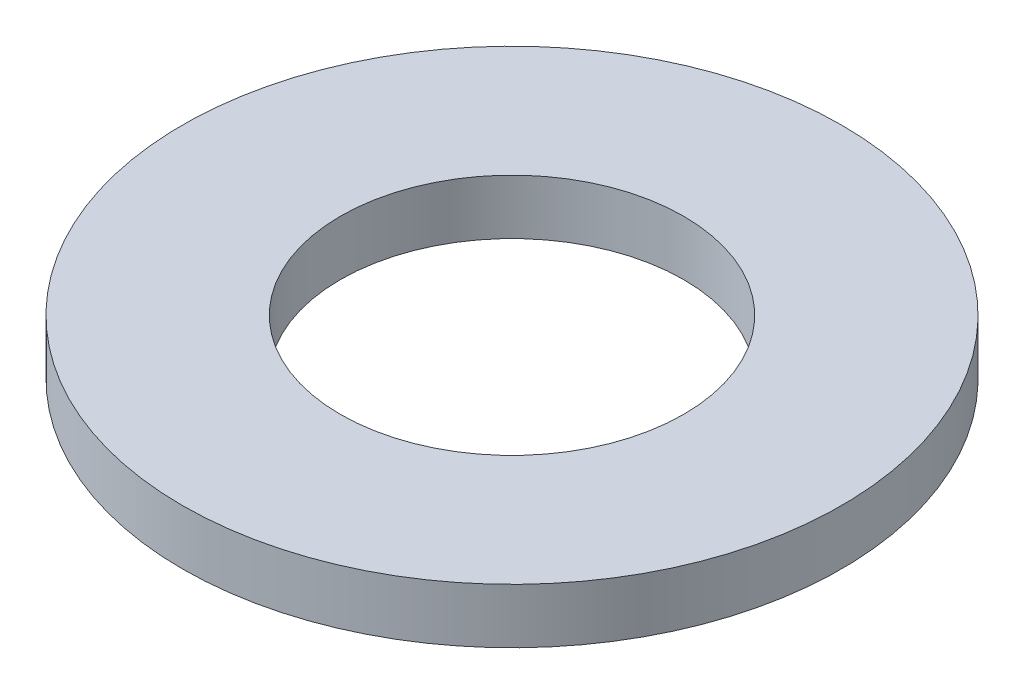
ISO-10303-21;
HEADER;
FILE_DESCRIPTION(('STEP AP214'),'2;1');
FILE_NAME('part.step','',(''),(''),'','','');
FILE_SCHEMA(('AUTOMOTIVE_DESIGN { 1 0 10303 214 1 1 1 1 }'));
ENDSEC;
DATA;
#1=APPLICATION_CONTEXT('core data for automotive mechanical design processes');
#2=APPLICATION_PROTOCOL_DEFINITION('international standard','automotive_design',2000,#1);
#3=PRODUCT_CONTEXT('',#1,'mechanical');
#4=PRODUCT('Part','Part','',(#3));
#5=PRODUCT_RELATED_PRODUCT_CATEGORY('part','',(#4));
#6=PRODUCT_DEFINITION_FORMATION('','',#4);
#7=PRODUCT_DEFINITION_CONTEXT('part definition',#1,'design');
#8=PRODUCT_DEFINITION('design','',#6,#7);
#9=PRODUCT_DEFINITION_SHAPE('','',#8);
#10=(LENGTH_UNIT() NAMED_UNIT(*) SI_UNIT(.MILLI.,.METRE.));
#11=(NAMED_UNIT(*) PLANE_ANGLE_UNIT() SI_UNIT($,.RADIAN.));
#12=(NAMED_UNIT(*) SI_UNIT($,.STERADIAN.) SOLID_ANGLE_UNIT());
#13=UNCERTAINTY_MEASURE_WITH_UNIT(LENGTH_MEASURE(1.E-05),#10,'distance_accuracy_value','');
#14=(GEOMETRIC_REPRESENTATION_CONTEXT(3) GLOBAL_UNCERTAINTY_ASSIGNED_CONTEXT((#13)) GLOBAL_UNIT_ASSIGNED_CONTEXT((#10,
#11,#12)) REPRESENTATION_CONTEXT('',''));
#15=CARTESIAN_POINT('',(0.,0.,0.));
#16=DIRECTION('',(0.,0.,1.));
#17=DIRECTION('',(1.,0.,0.));
#18=AXIS2_PLACEMENT_3D('',#15,#16,#17);
#19=CARTESIAN_POINT('',(0.,1.,0.));
#20=DIRECTION('',(0.,1.,0.));
#21=DIRECTION('',(0.,0.,1.));
#22=AXIS2_PLACEMENT_3D('',#19,#20,#21);
#23=PLANE('',#22);
#24=CARTESIAN_POINT('',(0.,1.,0.));
#25=DIRECTION('',(0.,1.,0.));
#26=DIRECTION('',(0.,0.,1.));
#27=AXIS2_PLACEMENT_3D('',#24,#25,#26);
#28=CIRCLE('',#27,6.);
#29=CARTESIAN_POINT('',(0.,1.,6.));
#30=VERTEX_POINT('',#29);
#31=EDGE_CURVE('E10',#30,#30,#28,.T.);
#32=ORIENTED_EDGE('',*,*,#31,.T.);
#33=EDGE_LOOP('',(#32));
#34=FACE_BOUND('',#33,.T.);
#35=CARTESIAN_POINT('',(0.,1.,0.));
#36=DIRECTION('',(0.,1.,0.));
#37=DIRECTION('',(0.,0.,1.));
#38=AXIS2_PLACEMENT_3D('',#35,#36,#37);
#39=CIRCLE('',#38,3.125);
#40=CARTESIAN_POINT('',(0.,1.,3.125));
#41=VERTEX_POINT('',#40);
#42=EDGE_CURVE('E46',#41,#41,#39,.T.);
#43=ORIENTED_EDGE('',*,*,#42,.F.);
#44=EDGE_LOOP('',(#43));
#45=FACE_BOUND('',#44,.T.);
#46=ADVANCED_FACE('F35',(#34,#45),#23,.T.);
#47=CARTESIAN_POINT('',(0.,0.,0.));
#48=DIRECTION('',(0.,1.,0.));
#49=DIRECTION('',(0.,0.,1.));
#50=AXIS2_PLACEMENT_3D('',#47,#48,#49);
#51=PLANE('',#50);
#52=CARTESIAN_POINT('',(0.,0.,0.));
#53=DIRECTION('',(0.,1.,0.));
#54=DIRECTION('',(0.,0.,1.));
#55=AXIS2_PLACEMENT_3D('',#52,#53,#54);
#56=CIRCLE('',#55,6.);
#57=CARTESIAN_POINT('',(0.,0.,6.));
#58=VERTEX_POINT('',#57);
#59=EDGE_CURVE('E39',#58,#58,#56,.T.);
#60=ORIENTED_EDGE('',*,*,#59,.F.);
#61=EDGE_LOOP('',(#60));
#62=FACE_BOUND('',#61,.T.);
#63=CARTESIAN_POINT('',(0.,0.,0.));
#64=DIRECTION('',(0.,1.,0.));
#65=DIRECTION('',(0.,0.,1.));
#66=AXIS2_PLACEMENT_3D('',#63,#64,#65);
#67=CIRCLE('',#66,3.125);
#68=CARTESIAN_POINT('',(0.,0.,3.125));
#69=VERTEX_POINT('',#68);
#70=EDGE_CURVE('E48',#69,#69,#67,.T.);
#71=ORIENTED_EDGE('',*,*,#70,.T.);
#72=EDGE_LOOP('',(#71));
#73=FACE_BOUND('',#72,.T.);
#74=ADVANCED_FACE('F58',(#62,#73),#51,.F.);
#75=CARTESIAN_POINT('',(0.,1.,0.));
#76=DIRECTION('',(0.,-1.,0.));
#77=DIRECTION('',(0.,0.,-1.));
#78=AXIS2_PLACEMENT_3D('',#75,#76,#77);
#79=CYLINDRICAL_SURFACE('',#78,6.);
#80=ORIENTED_EDGE('',*,*,#31,.F.);
#81=EDGE_LOOP('',(#80));
#82=FACE_BOUND('',#81,.T.);
#83=ORIENTED_EDGE('',*,*,#59,.T.);
#84=EDGE_LOOP('',(#83));
#85=FACE_BOUND('',#84,.T.);
#86=ADVANCED_FACE('F37',(#82,#85),#79,.T.);
#87=CARTESIAN_POINT('',(0.,1.,0.));
#88=DIRECTION('',(0.,-1.,0.));
#89=DIRECTION('',(0.,0.,-1.));
#90=AXIS2_PLACEMENT_3D('',#87,#88,#89);
#91=CYLINDRICAL_SURFACE('',#90,3.125);
#92=ORIENTED_EDGE('',*,*,#42,.T.);
#93=EDGE_LOOP('',(#92));
#94=FACE_BOUND('',#93,.T.);
#95=ORIENTED_EDGE('',*,*,#70,.F.);
#96=EDGE_LOOP('',(#95));
#97=FACE_BOUND('',#96,.T.);
#98=ADVANCED_FACE('F54',(#94,#97),#91,.F.);
#99=CLOSED_SHELL('',(#46,#74,#86,#98));
#100=MANIFOLD_SOLID_BREP('B2',#99);
#101=ADVANCED_BREP_SHAPE_REPRESENTATION('',(#18,#100),#14);
#102=SHAPE_DEFINITION_REPRESENTATION(#9,#101);
ENDSEC;
END-ISO-10303-21;
